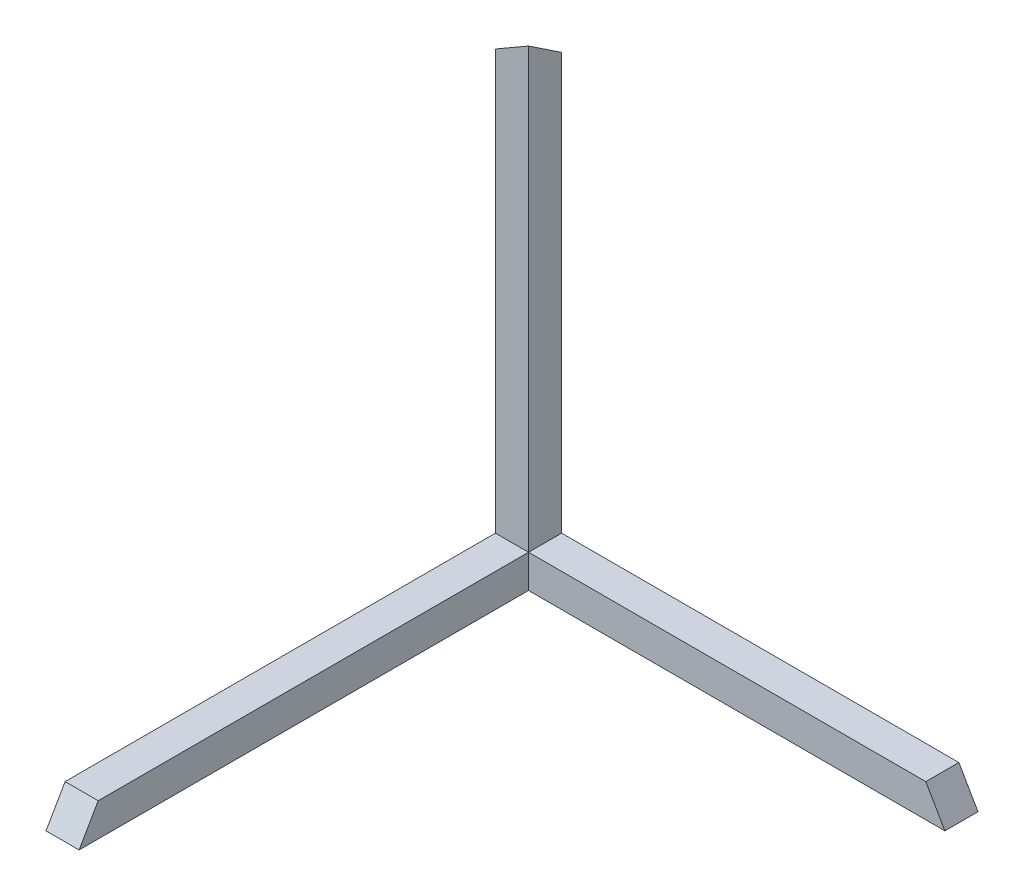
ISO-10303-21;
HEADER;
FILE_DESCRIPTION(('STEP AP214'),'2;1');
FILE_NAME('part.step','',(''),(''),'','','');
FILE_SCHEMA(('AUTOMOTIVE_DESIGN { 1 0 10303 214 1 1 1 1 }'));
ENDSEC;
DATA;
#1=APPLICATION_CONTEXT('core data for automotive mechanical design processes');
#2=APPLICATION_PROTOCOL_DEFINITION('international standard','automotive_design',2000,#1);
#3=PRODUCT_CONTEXT('',#1,'mechanical');
#4=PRODUCT('Part','Part','',(#3));
#5=PRODUCT_RELATED_PRODUCT_CATEGORY('part','',(#4));
#6=PRODUCT_DEFINITION_FORMATION('','',#4);
#7=PRODUCT_DEFINITION_CONTEXT('part definition',#1,'design');
#8=PRODUCT_DEFINITION('design','',#6,#7);
#9=PRODUCT_DEFINITION_SHAPE('','',#8);
#10=(LENGTH_UNIT() NAMED_UNIT(*) SI_UNIT(.MILLI.,.METRE.));
#11=(NAMED_UNIT(*) PLANE_ANGLE_UNIT() SI_UNIT($,.RADIAN.));
#12=(NAMED_UNIT(*) SI_UNIT($,.STERADIAN.) SOLID_ANGLE_UNIT());
#13=UNCERTAINTY_MEASURE_WITH_UNIT(LENGTH_MEASURE(1.E-05),#10,'distance_accuracy_value','');
#14=(GEOMETRIC_REPRESENTATION_CONTEXT(3) GLOBAL_UNCERTAINTY_ASSIGNED_CONTEXT((#13)) GLOBAL_UNIT_ASSIGNED_CONTEXT((#10,
#11,#12)) REPRESENTATION_CONTEXT('',''));
#15=CARTESIAN_POINT('',(0.,0.,0.));
#16=DIRECTION('',(0.,0.,1.));
#17=DIRECTION('',(1.,0.,0.));
#18=AXIS2_PLACEMENT_3D('',#15,#16,#17);
#19=CARTESIAN_POINT('',(-72.5074408291264,22.3679191654526,5.));
#20=DIRECTION('',(-1.,0.,0.));
#21=DIRECTION('',(0.,0.,1.));
#22=AXIS2_PLACEMENT_3D('',#19,#20,#21);
#23=PLANE('',#22);
#24=DIRECTION('',(0.,0.,-1.));
#25=VECTOR('',#24,1.);
#26=CARTESIAN_POINT('',(-72.5074408291264,-42.6320808345474,5.));
#27=LINE('',#26,#25);
#28=CARTESIAN_POINT('',(-72.5074408291264,-42.6320808345474,72.8867513459481));
#29=VERTEX_POINT('',#28);
#30=CARTESIAN_POINT('',(-72.5074408291264,-42.6320808345474,5.));
#31=VERTEX_POINT('',#30);
#32=EDGE_CURVE('E45',#29,#31,#27,.T.);
#33=ORIENTED_EDGE('',*,*,#32,.T.);
#34=DIRECTION('',(0.,1.,0.));
#35=VECTOR('',#34,1.);
#36=CARTESIAN_POINT('',(-72.5074408291264,22.3679191654526,5.));
#37=LINE('',#36,#35);
#38=CARTESIAN_POINT('',(-72.5074408291264,-37.6320808345474,5.));
#39=VERTEX_POINT('',#38);
#40=EDGE_CURVE('E128',#31,#39,#37,.T.);
#41=ORIENTED_EDGE('',*,*,#40,.T.);
#42=DIRECTION('',(0.,0.,1.));
#43=VECTOR('',#42,1.);
#44=CARTESIAN_POINT('',(-72.5074408291264,-37.6320808345474,5.));
#45=LINE('',#44,#43);
#46=CARTESIAN_POINT('',(-72.5074408291264,-37.6320808345474,70.));
#47=VERTEX_POINT('',#46);
#48=EDGE_CURVE('E139',#39,#47,#45,.T.);
#49=ORIENTED_EDGE('',*,*,#48,.T.);
#50=DIRECTION('',(0.,0.866025403784438,-0.500000000000001));
#51=VECTOR('',#50,1.);
#52=CARTESIAN_POINT('',(-72.5074408291264,35.5137447884468,27.7692378864667));
#53=LINE('',#52,#51);
#54=EDGE_CURVE('E141',#29,#47,#53,.T.);
#55=ORIENTED_EDGE('',*,*,#54,.F.);
#56=EDGE_LOOP('',(#33,#41,#49,#55));
#57=FACE_BOUND('',#56,.T.);
#58=ADVANCED_FACE('F35',(#57),#23,.F.);
#59=CARTESIAN_POINT('',(-77.5074408291264,22.3679191654526,5.));
#60=DIRECTION('',(1.,0.,0.));
#61=DIRECTION('',(0.,0.,-1.));
#62=AXIS2_PLACEMENT_3D('',#59,#60,#61);
#63=PLANE('',#62);
#64=DIRECTION('',(0.,-1.,0.));
#65=VECTOR('',#64,1.);
#66=CARTESIAN_POINT('',(-77.5074408291264,22.3679191654526,0.));
#67=LINE('',#66,#65);
#68=CARTESIAN_POINT('',(-77.5074408291264,22.3679191654526,0.));
#69=VERTEX_POINT('',#68);
#70=CARTESIAN_POINT('',(-77.5074408291264,-42.6320808345474,0.));
#71=VERTEX_POINT('',#70);
#72=EDGE_CURVE('E105',#69,#71,#67,.T.);
#73=ORIENTED_EDGE('',*,*,#72,.T.);
#74=DIRECTION('',(0.,0.,-1.));
#75=VECTOR('',#74,1.);
#76=CARTESIAN_POINT('',(-77.5074408291264,-42.6320808345474,5.));
#77=LINE('',#76,#75);
#78=CARTESIAN_POINT('',(-77.5074408291264,-42.6320808345474,72.8867513459481));
#79=VERTEX_POINT('',#78);
#80=EDGE_CURVE('E11',#79,#71,#77,.T.);
#81=ORIENTED_EDGE('',*,*,#80,.F.);
#82=DIRECTION('',(0.,0.866025403784438,-0.500000000000001));
#83=VECTOR('',#82,1.);
#84=CARTESIAN_POINT('',(-77.5074408291264,-37.6320808345474,70.));
#85=LINE('',#84,#83);
#86=CARTESIAN_POINT('',(-77.5074408291264,-37.6320808345474,70.));
#87=VERTEX_POINT('',#86);
#88=EDGE_CURVE('E136',#79,#87,#85,.T.);
#89=ORIENTED_EDGE('',*,*,#88,.T.);
#90=DIRECTION('',(0.,0.,1.));
#91=VECTOR('',#90,1.);
#92=CARTESIAN_POINT('',(-77.5074408291264,-37.6320808345474,5.));
#93=LINE('',#92,#91);
#94=CARTESIAN_POINT('',(-77.5074408291264,-37.6320808345474,5.));
#95=VERTEX_POINT('',#94);
#96=EDGE_CURVE('E140',#95,#87,#93,.T.);
#97=ORIENTED_EDGE('',*,*,#96,.F.);
#98=DIRECTION('',(0.,-1.,0.));
#99=VECTOR('',#98,1.);
#100=CARTESIAN_POINT('',(-77.5074408291264,22.3679191654526,5.));
#101=LINE('',#100,#99);
#102=CARTESIAN_POINT('',(-77.5074408291264,25.7012524987859,5.));
#103=VERTEX_POINT('',#102);
#104=EDGE_CURVE('E99',#103,#95,#101,.T.);
#105=ORIENTED_EDGE('',*,*,#104,.F.);
#106=DIRECTION('',(0.,0.55470019622523,0.832050294337843));
#107=VECTOR('',#106,1.);
#108=CARTESIAN_POINT('',(-77.5074408291264,24.6756114731449,3.46153846153845));
#109=LINE('',#108,#107);
#110=EDGE_CURVE('E39',#103,#69,#109,.F.);
#111=ORIENTED_EDGE('',*,*,#110,.T.);
#112=EDGE_LOOP('',(#73,#81,#89,#97,#105,#111));
#113=FACE_BOUND('',#112,.T.);
#114=ADVANCED_FACE('F104',(#113),#63,.F.);
#115=CARTESIAN_POINT('',(-77.5074408291264,-42.6320808345474,5.));
#116=DIRECTION('',(0.,1.,0.));
#117=DIRECTION('',(0.,0.,1.));
#118=AXIS2_PLACEMENT_3D('',#115,#116,#117);
#119=PLANE('',#118);
#120=ORIENTED_EDGE('',*,*,#80,.T.);
#121=DIRECTION('',(1.,0.,0.));
#122=VECTOR('',#121,1.);
#123=CARTESIAN_POINT('',(-77.5074408291264,-42.6320808345474,0.));
#124=LINE('',#123,#122);
#125=CARTESIAN_POINT('',(-9.62068948317822,-42.6320808345474,0.));
#126=VERTEX_POINT('',#125);
#127=EDGE_CURVE('E112',#71,#126,#124,.T.);
#128=ORIENTED_EDGE('',*,*,#127,.T.);
#129=DIRECTION('',(0.,0.,-1.));
#130=VECTOR('',#129,1.);
#131=CARTESIAN_POINT('',(-9.62068948317822,-42.6320808345474,5.));
#132=LINE('',#131,#130);
#133=CARTESIAN_POINT('',(-9.62068948317822,-42.6320808345474,5.));
#134=VERTEX_POINT('',#133);
#135=EDGE_CURVE('E130',#134,#126,#132,.T.);
#136=ORIENTED_EDGE('',*,*,#135,.F.);
#137=DIRECTION('',(1.,0.,0.));
#138=VECTOR('',#137,1.);
#139=CARTESIAN_POINT('',(-77.5074408291264,-42.6320808345474,5.));
#140=LINE('',#139,#138);
#141=EDGE_CURVE('E133',#31,#134,#140,.T.);
#142=ORIENTED_EDGE('',*,*,#141,.F.);
#143=ORIENTED_EDGE('',*,*,#32,.F.);
#144=DIRECTION('',(-1.,0.,0.));
#145=VECTOR('',#144,1.);
#146=CARTESIAN_POINT('',(-72.5074408291264,-42.6320808345474,72.8867513459481));
#147=LINE('',#146,#145);
#148=EDGE_CURVE('E144',#29,#79,#147,.T.);
#149=ORIENTED_EDGE('',*,*,#148,.T.);
#150=EDGE_LOOP('',(#120,#128,#136,#142,#143,#149));
#151=FACE_BOUND('',#150,.T.);
#152=ADVANCED_FACE('F178',(#151),#119,.F.);
#153=DIRECTION('',(0.,1.,0.));
#154=VECTOR('',#153,1.);
#155=CARTESIAN_POINT('',(-72.5074408291264,22.3679191654526,5.));
#156=LINE('',#155,#154);
#157=CARTESIAN_POINT('',(-72.5074408291264,28.5880038447341,5.));
#158=VERTEX_POINT('',#157);
#159=EDGE_CURVE('E84',#39,#158,#156,.T.);
#160=ORIENTED_EDGE('',*,*,#159,.F.);
#161=DIRECTION('',(0.,0.,-1.));
#162=VECTOR('',#161,1.);
#163=CARTESIAN_POINT('',(-72.5074408291264,-37.6320808345474,5.));
#164=LINE('',#163,#162);
#165=CARTESIAN_POINT('',(-72.5074408291264,-37.6320808345474,0.));
#166=VERTEX_POINT('',#165);
#167=EDGE_CURVE('E153',#39,#166,#164,.T.);
#168=ORIENTED_EDGE('',*,*,#167,.T.);
#169=DIRECTION('',(0.,1.,0.));
#170=VECTOR('',#169,1.);
#171=CARTESIAN_POINT('',(-72.5074408291264,22.3679191654526,0.));
#172=LINE('',#171,#170);
#173=CARTESIAN_POINT('',(-72.5074408291264,25.2546705114007,0.));
#174=VERTEX_POINT('',#173);
#175=EDGE_CURVE('E100',#166,#174,#172,.T.);
#176=ORIENTED_EDGE('',*,*,#175,.T.);
#177=DIRECTION('',(0.,0.55470019622523,0.832050294337843));
#178=VECTOR('',#177,1.);
#179=CARTESIAN_POINT('',(-72.5074408291264,24.366439328032,-1.33234677505299));
#180=LINE('',#179,#178);
#181=EDGE_CURVE('E95',#158,#174,#180,.F.);
#182=ORIENTED_EDGE('',*,*,#181,.F.);
#183=EDGE_LOOP('',(#160,#168,#176,#182));
#184=FACE_BOUND('',#183,.T.);
#185=ADVANCED_FACE('F190',(#184),#23,.F.);
#186=CARTESIAN_POINT('',(-77.5074408291264,22.3679191654526,0.));
#187=DIRECTION('',(-0.43301270189222,0.749999999999999,-0.500000000000001));
#188=DIRECTION('',(0.,0.55470019622523,0.832050294337843));
#189=AXIS2_PLACEMENT_3D('',#186,#187,#188);
#190=PLANE('',#189);
#191=DIRECTION('',(0.866025403784438,0.500000000000001,0.));
#192=VECTOR('',#191,1.);
#193=CARTESIAN_POINT('',(-77.5074408291264,22.3679191654526,0.));
#194=LINE('',#193,#192);
#195=EDGE_CURVE('E91',#174,#69,#194,.F.);
#196=ORIENTED_EDGE('',*,*,#195,.T.);
#197=ORIENTED_EDGE('',*,*,#110,.F.);
#198=DIRECTION('',(0.866025403784438,0.500000000000001,0.));
#199=VECTOR('',#198,1.);
#200=CARTESIAN_POINT('',(-78.9508165021004,24.8679191654526,5.));
#201=LINE('',#200,#199);
#202=EDGE_CURVE('E109',#158,#103,#201,.F.);
#203=ORIENTED_EDGE('',*,*,#202,.F.);
#204=ORIENTED_EDGE('',*,*,#181,.T.);
#205=EDGE_LOOP('',(#196,#197,#203,#204));
#206=FACE_BOUND('',#205,.T.);
#207=ADVANCED_FACE('F37',(#206),#190,.T.);
#208=CARTESIAN_POINT('',(0.,0.,5.));
#209=DIRECTION('',(0.,0.,1.));
#210=DIRECTION('',(1.,0.,0.));
#211=AXIS2_PLACEMENT_3D('',#208,#209,#210);
#212=PLANE('',#211);
#213=DIRECTION('',(-1.,0.,0.));
#214=VECTOR('',#213,1.);
#215=CARTESIAN_POINT('',(-72.5074408291264,-37.6320808345474,5.));
#216=LINE('',#215,#214);
#217=EDGE_CURVE('E113',#39,#95,#216,.T.);
#218=ORIENTED_EDGE('',*,*,#217,.F.);
#219=ORIENTED_EDGE('',*,*,#159,.T.);
#220=ORIENTED_EDGE('',*,*,#202,.T.);
#221=ORIENTED_EDGE('',*,*,#104,.T.);
#222=EDGE_LOOP('',(#218,#219,#220,#221));
#223=FACE_BOUND('',#222,.T.);
#224=ADVANCED_FACE('F187',(#223),#212,.T.);
#225=CARTESIAN_POINT('',(0.,0.,0.));
#226=DIRECTION('',(0.,0.,1.));
#227=DIRECTION('',(1.,0.,0.));
#228=AXIS2_PLACEMENT_3D('',#225,#226,#227);
#229=PLANE('',#228);
#230=ORIENTED_EDGE('',*,*,#175,.F.);
#231=DIRECTION('',(-1.,0.,0.));
#232=VECTOR('',#231,1.);
#233=CARTESIAN_POINT('',(-77.5074408291264,-37.6320808345474,0.));
#234=LINE('',#233,#232);
#235=CARTESIAN_POINT('',(-12.5074408291264,-37.6320808345474,0.));
#236=VERTEX_POINT('',#235);
#237=EDGE_CURVE('E53',#236,#166,#234,.T.);
#238=ORIENTED_EDGE('',*,*,#237,.F.);
#239=DIRECTION('',(-0.500000000000001,0.866025403784438,0.));
#240=VECTOR('',#239,1.);
#241=CARTESIAN_POINT('',(-25.6757496218386,-14.823900955814,0.));
#242=LINE('',#241,#240);
#243=EDGE_CURVE('E125',#126,#236,#242,.T.);
#244=ORIENTED_EDGE('',*,*,#243,.F.);
#245=ORIENTED_EDGE('',*,*,#127,.F.);
#246=ORIENTED_EDGE('',*,*,#72,.F.);
#247=ORIENTED_EDGE('',*,*,#195,.F.);
#248=EDGE_LOOP('',(#230,#238,#244,#245,#246,#247));
#249=FACE_BOUND('',#248,.T.);
#250=ADVANCED_FACE('F110',(#249),#229,.F.);
#251=CARTESIAN_POINT('',(-72.5074408291264,-37.6320808345474,5.));
#252=DIRECTION('',(0.,-1.,0.));
#253=DIRECTION('',(0.,0.,-1.));
#254=AXIS2_PLACEMENT_3D('',#251,#252,#253);
#255=PLANE('',#254);
#256=ORIENTED_EDGE('',*,*,#96,.T.);
#257=DIRECTION('',(-1.,0.,0.));
#258=VECTOR('',#257,1.);
#259=CARTESIAN_POINT('',(-72.5074408291264,-37.6320808345474,70.));
#260=LINE('',#259,#258);
#261=EDGE_CURVE('E117',#47,#87,#260,.T.);
#262=ORIENTED_EDGE('',*,*,#261,.F.);
#263=ORIENTED_EDGE('',*,*,#48,.F.);
#264=ORIENTED_EDGE('',*,*,#217,.T.);
#265=EDGE_LOOP('',(#256,#262,#263,#264));
#266=FACE_BOUND('',#265,.T.);
#267=ADVANCED_FACE('F191',(#266),#255,.F.);
#268=CARTESIAN_POINT('',(-72.5074408291264,-37.6320808345474,70.));
#269=DIRECTION('',(0.,0.500000000000001,0.866025403784438));
#270=DIRECTION('',(0.,-0.866025403784438,0.500000000000001));
#271=AXIS2_PLACEMENT_3D('',#268,#269,#270);
#272=PLANE('',#271);
#273=ORIENTED_EDGE('',*,*,#88,.F.);
#274=ORIENTED_EDGE('',*,*,#148,.F.);
#275=ORIENTED_EDGE('',*,*,#54,.T.);
#276=ORIENTED_EDGE('',*,*,#261,.T.);
#277=EDGE_LOOP('',(#273,#274,#275,#276));
#278=FACE_BOUND('',#277,.T.);
#279=ADVANCED_FACE('F196',(#278),#272,.T.);
#280=CARTESIAN_POINT('',(0.,-37.6320808345474,0.));
#281=DIRECTION('',(0.,1.,0.));
#282=DIRECTION('',(0.,0.,1.));
#283=AXIS2_PLACEMENT_3D('',#280,#281,#282);
#284=PLANE('',#283);
#285=ORIENTED_EDGE('',*,*,#167,.F.);
#286=DIRECTION('',(1.,0.,0.));
#287=VECTOR('',#286,1.);
#288=CARTESIAN_POINT('',(-77.5074408291264,-37.6320808345474,5.));
#289=LINE('',#288,#287);
#290=CARTESIAN_POINT('',(-12.5074408291264,-37.6320808345474,5.));
#291=VERTEX_POINT('',#290);
#292=EDGE_CURVE('E162',#39,#291,#289,.T.);
#293=ORIENTED_EDGE('',*,*,#292,.T.);
#294=DIRECTION('',(0.,0.,-1.));
#295=VECTOR('',#294,1.);
#296=CARTESIAN_POINT('',(-12.5074408291264,-37.6320808345474,0.));
#297=LINE('',#296,#295);
#298=EDGE_CURVE('E160',#291,#236,#297,.T.);
#299=ORIENTED_EDGE('',*,*,#298,.T.);
#300=ORIENTED_EDGE('',*,*,#237,.T.);
#301=EDGE_LOOP('',(#285,#293,#299,#300));
#302=FACE_BOUND('',#301,.T.);
#303=ADVANCED_FACE('F180',(#302),#284,.T.);
#304=CARTESIAN_POINT('',(-77.5074408291264,-42.6320808345474,5.));
#305=DIRECTION('',(0.,0.,1.));
#306=DIRECTION('',(1.,0.,0.));
#307=AXIS2_PLACEMENT_3D('',#304,#305,#306);
#308=PLANE('',#307);
#309=ORIENTED_EDGE('',*,*,#40,.F.);
#310=ORIENTED_EDGE('',*,*,#141,.T.);
#311=DIRECTION('',(-0.500000000000001,0.866025403784438,0.));
#312=VECTOR('',#311,1.);
#313=CARTESIAN_POINT('',(-26.5923773196653,-13.2362552115531,5.));
#314=LINE('',#313,#312);
#315=EDGE_CURVE('E129',#134,#291,#314,.T.);
#316=ORIENTED_EDGE('',*,*,#315,.T.);
#317=ORIENTED_EDGE('',*,*,#292,.F.);
#318=EDGE_LOOP('',(#309,#310,#316,#317));
#319=FACE_BOUND('',#318,.T.);
#320=ADVANCED_FACE('F169',(#319),#308,.T.);
#321=CARTESIAN_POINT('',(-12.5074408291264,-37.6320808345474,0.));
#322=DIRECTION('',(0.866025403784438,0.500000000000001,0.));
#323=DIRECTION('',(-0.500000000000001,0.866025403784438,0.));
#324=AXIS2_PLACEMENT_3D('',#321,#322,#323);
#325=PLANE('',#324);
#326=ORIENTED_EDGE('',*,*,#298,.F.);
#327=ORIENTED_EDGE('',*,*,#315,.F.);
#328=ORIENTED_EDGE('',*,*,#135,.T.);
#329=ORIENTED_EDGE('',*,*,#243,.T.);
#330=EDGE_LOOP('',(#326,#327,#328,#329));
#331=FACE_BOUND('',#330,.T.);
#332=ADVANCED_FACE('F177',(#331),#325,.T.);
#333=CLOSED_SHELL('',(#58,#114,#152,#185,#207,#224,#250,#267,#279,#303,#320,#332));
#334=MANIFOLD_SOLID_BREP('B2',#333);
#335=ADVANCED_BREP_SHAPE_REPRESENTATION('',(#18,#334),#14);
#336=SHAPE_DEFINITION_REPRESENTATION(#9,#335);
ENDSEC;
END-ISO-10303-21;
